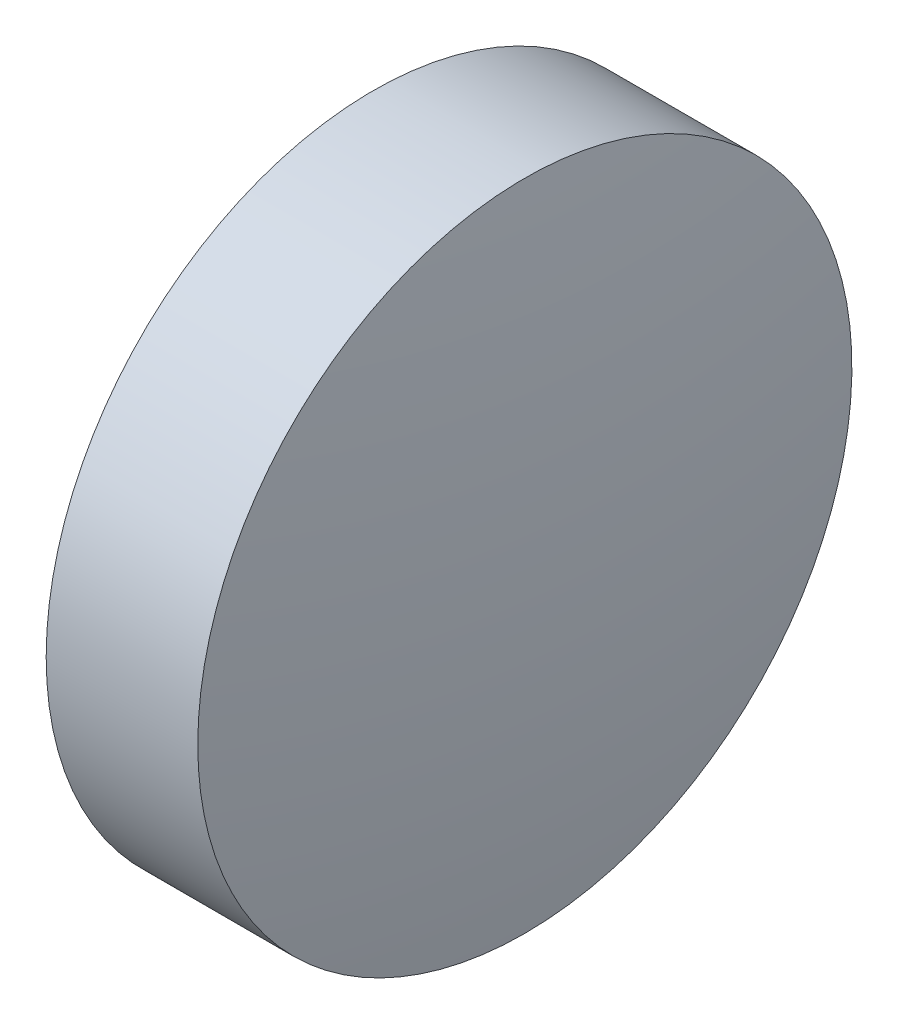
ISO-10303-21;
HEADER;
FILE_DESCRIPTION(('STEP AP214'),'2;1');
FILE_NAME('part.step','',(''),(''),'','','');
FILE_SCHEMA(('AUTOMOTIVE_DESIGN { 1 0 10303 214 1 1 1 1 }'));
ENDSEC;
DATA;
#1=APPLICATION_CONTEXT('core data for automotive mechanical design processes');
#2=APPLICATION_PROTOCOL_DEFINITION('international standard','automotive_design',2000,#1);
#3=PRODUCT_CONTEXT('',#1,'mechanical');
#4=PRODUCT('Part','Part','',(#3));
#5=PRODUCT_RELATED_PRODUCT_CATEGORY('part','',(#4));
#6=PRODUCT_DEFINITION_FORMATION('','',#4);
#7=PRODUCT_DEFINITION_CONTEXT('part definition',#1,'design');
#8=PRODUCT_DEFINITION('design','',#6,#7);
#9=PRODUCT_DEFINITION_SHAPE('','',#8);
#10=(LENGTH_UNIT() NAMED_UNIT(*) SI_UNIT(.MILLI.,.METRE.));
#11=(NAMED_UNIT(*) PLANE_ANGLE_UNIT() SI_UNIT($,.RADIAN.));
#12=(NAMED_UNIT(*) SI_UNIT($,.STERADIAN.) SOLID_ANGLE_UNIT());
#13=UNCERTAINTY_MEASURE_WITH_UNIT(LENGTH_MEASURE(1.E-05),#10,'distance_accuracy_value','');
#14=(GEOMETRIC_REPRESENTATION_CONTEXT(3) GLOBAL_UNCERTAINTY_ASSIGNED_CONTEXT((#13)) GLOBAL_UNIT_ASSIGNED_CONTEXT((#10,
#11,#12)) REPRESENTATION_CONTEXT('',''));
#15=CARTESIAN_POINT('',(0.,0.,0.));
#16=DIRECTION('',(0.,0.,1.));
#17=DIRECTION('',(1.,0.,0.));
#18=AXIS2_PLACEMENT_3D('',#15,#16,#17);
#19=CARTESIAN_POINT('',(604.495527801009,93.6314283999944,0.));
#20=DIRECTION('',(-1.,0.,0.));
#21=DIRECTION('',(0.,-1.,0.));
#22=AXIS2_PLACEMENT_3D('',#19,#20,#21);
#23=SPHERICAL_SURFACE('',#22,20.7918749999999);
#24=CARTESIAN_POINT('',(625.047402801009,93.6314283999942,0.));
#25=DIRECTION('',(-1.,0.,0.));
#26=DIRECTION('',(0.,0.,1.));
#27=AXIS2_PLACEMENT_3D('',#24,#25,#26);
#28=CIRCLE('',#27,3.14999999999999);
#29=CARTESIAN_POINT('',(625.047402801009,93.6314283999942,3.14999999999999));
#30=VERTEX_POINT('',#29);
#31=EDGE_CURVE('E10',#30,#30,#28,.T.);
#32=ORIENTED_EDGE('',*,*,#31,.F.);
#33=EDGE_LOOP('',(#32));
#34=FACE_BOUND('',#33,.T.);
#35=ADVANCED_FACE('F35',(#34),#23,.T.);
#36=CARTESIAN_POINT('',(622.725774631425,93.6314283999942,0.));
#37=DIRECTION('',(-1.,0.,0.));
#38=DIRECTION('',(0.,0.,1.));
#39=AXIS2_PLACEMENT_3D('',#36,#37,#38);
#40=CYLINDRICAL_SURFACE('',#39,3.14999999999999);
#41=CARTESIAN_POINT('',(623.587402801009,93.6314283999942,0.));
#42=DIRECTION('',(-1.,0.,0.));
#43=DIRECTION('',(0.,0.,1.));
#44=AXIS2_PLACEMENT_3D('',#41,#42,#43);
#45=CIRCLE('',#44,3.14999999999999);
#46=CARTESIAN_POINT('',(623.587402801009,93.6314283999942,3.14999999999999));
#47=VERTEX_POINT('',#46);
#48=EDGE_CURVE('E41',#47,#47,#45,.T.);
#49=ORIENTED_EDGE('',*,*,#48,.F.);
#50=EDGE_LOOP('',(#49));
#51=FACE_BOUND('',#50,.T.);
#52=ORIENTED_EDGE('',*,*,#31,.T.);
#53=EDGE_LOOP('',(#52));
#54=FACE_BOUND('',#53,.T.);
#55=ADVANCED_FACE('F49',(#51,#54),#40,.T.);
#56=CARTESIAN_POINT('',(623.587402801009,93.6314283999942,0.));
#57=DIRECTION('',(1.,0.,0.));
#58=DIRECTION('',(0.,0.,-1.));
#59=AXIS2_PLACEMENT_3D('',#56,#57,#58);
#60=PLANE('',#59);
#61=ORIENTED_EDGE('',*,*,#48,.T.);
#62=EDGE_LOOP('',(#61));
#63=FACE_BOUND('',#62,.T.);
#64=ADVANCED_FACE('F47',(#63),#60,.F.);
#65=CLOSED_SHELL('',(#35,#55,#64));
#66=MANIFOLD_SOLID_BREP('B2',#65);
#67=ADVANCED_BREP_SHAPE_REPRESENTATION('',(#18,#66),#14);
#68=SHAPE_DEFINITION_REPRESENTATION(#9,#67);
ENDSEC;
END-ISO-10303-21;
